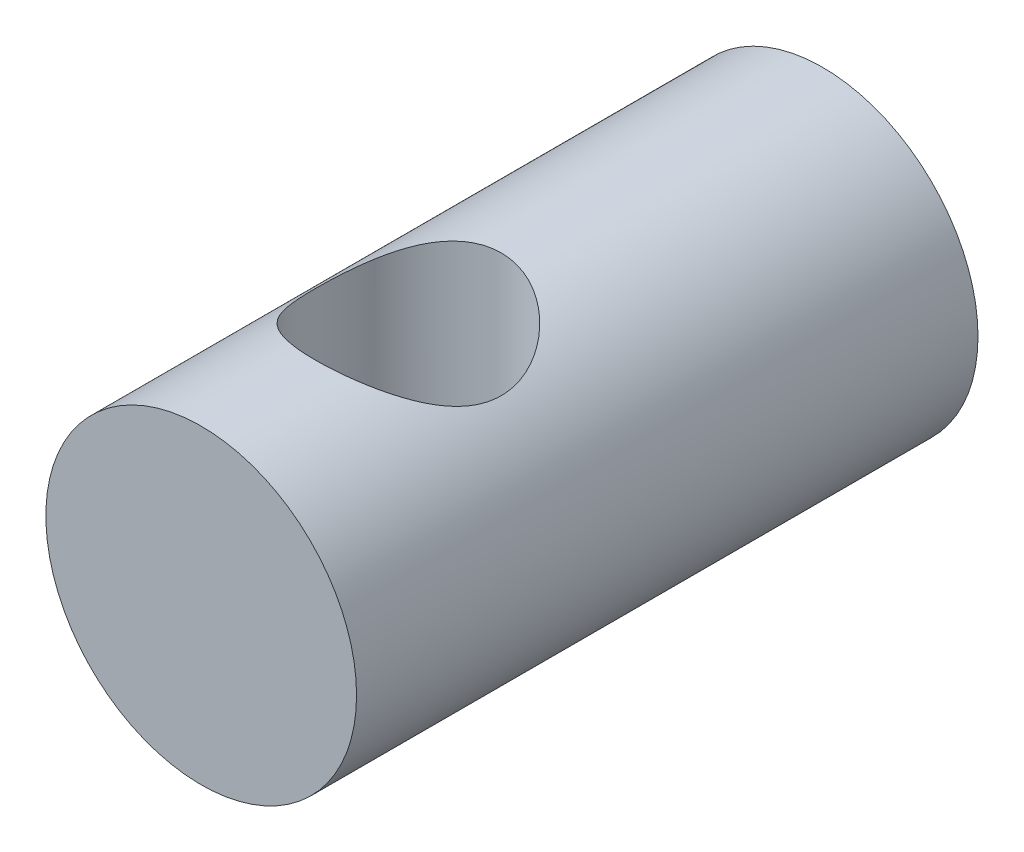
ISO-10303-21;
HEADER;
FILE_DESCRIPTION(('STEP AP214'),'2;1');
FILE_NAME('part.step','',(''),(''),'','','');
FILE_SCHEMA(('AUTOMOTIVE_DESIGN { 1 0 10303 214 1 1 1 1 }'));
ENDSEC;
DATA;
#1=APPLICATION_CONTEXT('core data for automotive mechanical design processes');
#2=APPLICATION_PROTOCOL_DEFINITION('international standard','automotive_design',2000,#1);
#3=PRODUCT_CONTEXT('',#1,'mechanical');
#4=PRODUCT('Part','Part','',(#3));
#5=PRODUCT_RELATED_PRODUCT_CATEGORY('part','',(#4));
#6=PRODUCT_DEFINITION_FORMATION('','',#4);
#7=PRODUCT_DEFINITION_CONTEXT('part definition',#1,'design');
#8=PRODUCT_DEFINITION('design','',#6,#7);
#9=PRODUCT_DEFINITION_SHAPE('','',#8);
#10=(LENGTH_UNIT() NAMED_UNIT(*) SI_UNIT(.MILLI.,.METRE.));
#11=(NAMED_UNIT(*) PLANE_ANGLE_UNIT() SI_UNIT($,.RADIAN.));
#12=(NAMED_UNIT(*) SI_UNIT($,.STERADIAN.) SOLID_ANGLE_UNIT());
#13=UNCERTAINTY_MEASURE_WITH_UNIT(LENGTH_MEASURE(1.E-05),#10,'distance_accuracy_value','');
#14=(GEOMETRIC_REPRESENTATION_CONTEXT(3) GLOBAL_UNCERTAINTY_ASSIGNED_CONTEXT((#13)) GLOBAL_UNIT_ASSIGNED_CONTEXT((#10,
#11,#12)) REPRESENTATION_CONTEXT('',''));
#15=CARTESIAN_POINT('',(0.,0.,0.));
#16=DIRECTION('',(0.,0.,1.));
#17=DIRECTION('',(1.,0.,0.));
#18=AXIS2_PLACEMENT_3D('',#15,#16,#17);
#19=CARTESIAN_POINT('',(0.,0.,12.7));
#20=DIRECTION('',(0.,0.,-1.));
#21=DIRECTION('',(-1.,0.,0.));
#22=AXIS2_PLACEMENT_3D('',#19,#20,#21);
#23=CYLINDRICAL_SURFACE('',#22,3.175);
#24=CARTESIAN_POINT('',(0.,-3.175,10.365316582));
#25=CARTESIAN_POINT('',(0.097172169504171,-3.17499473733448,10.3653107740274));
#26=CARTESIAN_POINT('',(0.194505772171724,-3.1704899351168,10.3578039193283));
#27=CARTESIAN_POINT('',(0.386247876195257,-3.15289724445,10.3281566819524));
#28=CARTESIAN_POINT('',(0.48064841814607,-3.13978783032978,10.3059795985024));
#29=CARTESIAN_POINT('',(0.663338202960632,-3.10631453914764,10.2482349678898));
#30=CARTESIAN_POINT('',(0.75165520508708,-3.08598663827969,10.2127337776368));
#31=CARTESIAN_POINT('',(0.920802871190098,-3.03980996111726,10.1297592927874));
#32=CARTESIAN_POINT('',(1.00163547058606,-3.0139626178641,10.0822891051864));
#33=CARTESIAN_POINT('',(1.16049252060854,-2.95661027604282,9.97270073098784));
#34=CARTESIAN_POINT('',(1.23783381861576,-2.92482426540909,9.90974208688833));
#35=CARTESIAN_POINT('',(1.38152642634457,-2.85976318298787,9.77285265622814));
#36=CARTESIAN_POINT('',(1.44786347487478,-2.82648624881524,9.69890786345869));
#37=CARTESIAN_POINT('',(1.57584554094794,-2.7573969106236,9.53155790583001));
#38=CARTESIAN_POINT('',(1.6359388108928,-2.72176832488568,9.43687972758724));
#39=CARTESIAN_POINT('',(1.73913402629444,-2.65702180796901,9.23667491079906));
#40=CARTESIAN_POINT('',(1.78226344099681,-2.62789338457552,9.131166162321));
#41=CARTESIAN_POINT('',(1.84124574883968,-2.58677571161618,8.93813594880242));
#42=CARTESIAN_POINT('',(1.86116114936056,-2.57235066712384,8.85237681030291));
#43=CARTESIAN_POINT('',(1.88891287200302,-2.55204635151922,8.67797576197779));
#44=CARTESIAN_POINT('',(1.89676405751958,-2.54615656527941,8.58933753703125));
#45=CARTESIAN_POINT('',(1.89993521562899,-2.54379182699535,8.41153783263795));
#46=CARTESIAN_POINT('',(1.89523118653523,-2.54733490764222,8.32237567657212));
#47=CARTESIAN_POINT('',(1.87353957703253,-2.56332717440686,8.1463563269842));
#48=CARTESIAN_POINT('',(1.85654281014564,-2.57578302104399,8.05950090766198));
#49=CARTESIAN_POINT('',(1.81144682058197,-2.60768613385456,7.89131495149002));
#50=CARTESIAN_POINT('',(1.78348568689054,-2.62704618159416,7.80992990634508));
#51=CARTESIAN_POINT('',(1.7174830741452,-2.67066254406486,7.65278942963934));
#52=CARTESIAN_POINT('',(1.67943788818222,-2.69492065854811,7.57703608143616));
#53=CARTESIAN_POINT('',(1.58672414020791,-2.75069759525318,7.41931820479224));
#54=CARTESIAN_POINT('',(1.53031553227878,-2.78274553828709,7.33856308020759));
#55=CARTESIAN_POINT('',(1.40589250511398,-2.84763476747711,7.18683119944632));
#56=CARTESIAN_POINT('',(1.33786706770623,-2.88047678116024,7.11586384322752));
#57=CARTESIAN_POINT('',(1.1810184925224,-2.94857405920886,6.9758353773754));
#58=CARTESIAN_POINT('',(1.0906218793418,-2.98354055000555,6.90837705511171));
#59=CARTESIAN_POINT('',(0.897655771105431,-3.04715194844812,6.78979934297001));
#60=CARTESIAN_POINT('',(0.795092934616743,-3.07580028968896,6.73867107172912));
#61=CARTESIAN_POINT('',(0.587246926940642,-3.12191592586998,6.65790107119861));
#62=CARTESIAN_POINT('',(0.482552010341208,-3.13997863496482,6.62709924982464));
#63=CARTESIAN_POINT('',(0.268218469351468,-3.16548279140979,6.58389176699014));
#64=CARTESIAN_POINT('',(0.158585853436774,-3.17293680604301,6.57146433815708));
#65=CARTESIAN_POINT('',(-0.0464594408306201,-3.17608971445388,6.56619651713815));
#66=CARTESIAN_POINT('',(-0.141797439375055,-3.17323736279414,6.57094225903338));
#67=CARTESIAN_POINT('',(-0.330075000877257,-3.15920579927562,6.59452364476689));
#68=CARTESIAN_POINT('',(-0.423014604928156,-3.14802673018162,6.61335904703255));
#69=CARTESIAN_POINT('',(-0.601841757346878,-3.11872468347478,6.66358778940734));
#70=CARTESIAN_POINT('',(-0.687842979442191,-3.10076906658602,6.69467920637583));
#71=CARTESIAN_POINT('',(-0.853395669196843,-3.05935134067238,6.76819711147863));
#72=CARTESIAN_POINT('',(-0.932945842775101,-3.03588813048196,6.81062586658864));
#73=CARTESIAN_POINT('',(-1.09227149435585,-2.98250562345771,6.91053219907377));
#74=CARTESIAN_POINT('',(-1.17121199585691,-2.9521688658866,6.96911517831521));
#75=CARTESIAN_POINT('',(-1.31874135614903,-2.88928920038512,7.09723008447915));
#76=CARTESIAN_POINT('',(-1.38731797014928,-2.85674374765865,7.1667747674443));
#77=CARTESIAN_POINT('',(-1.52127553416577,-2.78795863350635,7.32530243889645));
#78=CARTESIAN_POINT('',(-1.58510202260847,-2.75178424164386,7.41563574983515));
#79=CARTESIAN_POINT('',(-1.69670447642633,-2.68441351776578,7.60740072133645));
#80=CARTESIAN_POINT('',(-1.74449774143377,-2.65321183947189,7.7088202622717));
#81=CARTESIAN_POINT('',(-1.81359870059369,-2.60630783041182,7.89785071518832));
#82=CARTESIAN_POINT('',(-1.83839773989258,-2.58871328079639,7.98371089566738));
#83=CARTESIAN_POINT('',(-1.87574133757355,-2.56178872180519,8.15926901710409));
#84=CARTESIAN_POINT('',(-1.88830268454364,-2.55244739168528,8.24896152363803));
#85=CARTESIAN_POINT('',(-1.90047164452545,-2.54340279632311,8.43005599464393));
#86=CARTESIAN_POINT('',(-1.90003234357775,-2.54373443676739,8.5214629603417));
#87=CARTESIAN_POINT('',(-1.88611100257841,-2.55407083156873,8.70274107034059));
#88=CARTESIAN_POINT('',(-1.8726217331441,-2.56408094757707,8.79261133526037));
#89=CARTESIAN_POINT('',(-1.83431553008192,-2.59160705495965,8.96420171931602));
#90=CARTESIAN_POINT('',(-1.81004575678639,-2.6087582409512,9.04610659928805));
#91=CARTESIAN_POINT('',(-1.75135686598518,-2.64851399533443,9.20476163253867));
#92=CARTESIAN_POINT('',(-1.7169339342481,-2.67112061258355,9.28150983528362));
#93=CARTESIAN_POINT('',(-1.63283008968824,-2.72347195098669,9.44032370395467));
#94=CARTESIAN_POINT('',(-1.58161638925408,-2.75377977993822,9.52139032781655));
#95=CARTESIAN_POINT('',(-1.46796619901477,-2.81600891017828,9.67458141690084));
#96=CARTESIAN_POINT('',(-1.40552049819928,-2.84793152013772,9.74669846020501));
#97=CARTESIAN_POINT('',(-1.25938084169048,-2.91582938156112,9.89181840377736));
#98=CARTESIAN_POINT('',(-1.1738851968346,-2.95163294738113,9.96310644919709));
#99=CARTESIAN_POINT('',(-0.990349204787433,-3.01817353695183,10.0904152904676));
#100=CARTESIAN_POINT('',(-0.892304594267355,-3.04890883067221,10.1464308773837));
#101=CARTESIAN_POINT('',(-0.689127454968951,-3.10101708385451,10.2392315277227));
#102=CARTESIAN_POINT('',(-0.584333119665005,-3.12266418626807,10.2765873524574));
#103=CARTESIAN_POINT('',(-0.42260364202049,-3.14722498197893,10.3185277566643));
#104=CARTESIAN_POINT('',(-0.367997826631686,-3.15409049809309,10.3301541115143));
#105=CARTESIAN_POINT('',(-0.257714777878128,-3.16500625364528,10.3485723619798));
#106=CARTESIAN_POINT('',(-0.202038485281639,-3.16905885848792,10.3553683196394));
#107=CARTESIAN_POINT('',(-0.12183446499626,-3.17275503945506,10.361560516765));
#108=CARTESIAN_POINT('',(-0.0974978003970843,-3.17359593319021,10.3629680082939));
#109=CARTESIAN_POINT('',(-0.048777482650045,-3.1747190827558,10.3648467845516));
#110=CARTESIAN_POINT('',(-0.0243938280572918,-3.17500132112475,10.3653180400171));
#111=CARTESIAN_POINT('',(0.,-3.175,10.365316582));
#112=B_SPLINE_CURVE_WITH_KNOTS('',3,(#24,#25,#26,#27,#28,#29,#30,#31,#32,#33,#34,#35,#36,#37,
#38,#39,#40,#41,#42,#43,#44,#45,#46,#47,#48,#49,#50,#51,#52,#53,#54,#55,#56,#57,#58,#59,#60,#61,
#62,#63,#64,#65,#66,#67,#68,#69,#70,#71,#72,#73,#74,#75,#76,#77,#78,#79,#80,#81,#82,#83,#84,#85,
#86,#87,#88,#89,#90,#91,#92,#93,#94,#95,#96,#97,#98,#99,#100,#101,#102,#103,#104,#105,#106,#107,
#108,#109,#110,#111),.UNSPECIFIED.,.T.,.F.,(4,2,2,2,2,2,2,2,2,2,2,2,2,2,2,2,2,2,2,2,2,2,2,2,2,2,
2,2,2,2,2,2,2,2,2,2,2,2,2,2,2,2,2,4),(0.,0.291416779287852,0.583565372317157,0.874277903798662,
1.16491504765874,1.47769532259325,1.79087783742579,2.14214785566549,2.49284670402168,
2.75935667027434,3.02553802600597,3.29222860244389,3.55911868544993,3.82275017836242,
4.08647871724115,4.39605203096701,4.70592061211438,5.05838095995927,5.41064928882317,
5.74050489129697,6.06996941369516,6.35503525304086,6.64009620493548,6.91853438364008,
7.19702827961615,7.5044512822629,7.81223470820557,8.15973748058237,8.50686408703163,
8.77899324108165,9.05074853994624,9.32348461042407,9.59637185698692,9.85675961477032,
10.1172453171383,10.4178141100819,10.7186305232669,11.0677182661434,11.4169249228814,
11.7546716756256,11.9231878050201,12.0915620553098,12.1647162172466,12.2378726656745),.UNSPECIFIED.);
#113=CARTESIAN_POINT('',(0.,-3.175,10.365316582));
#114=VERTEX_POINT('',#113);
#115=EDGE_CURVE('E10',#114,#114,#112,.T.);
#116=ORIENTED_EDGE('',*,*,#115,.T.);
#117=EDGE_LOOP('',(#116));
#118=FACE_BOUND('',#117,.T.);
#119=CARTESIAN_POINT('',(0.,3.175,10.365316582));
#120=CARTESIAN_POINT('',(-0.097172169504171,3.17499473733448,10.3653107740274));
#121=CARTESIAN_POINT('',(-0.194505772171724,3.1704899351168,10.3578039193283));
#122=CARTESIAN_POINT('',(-0.386247876195257,3.15289724445,10.3281566819524));
#123=CARTESIAN_POINT('',(-0.48064841814607,3.13978783032978,10.3059795985024));
#124=CARTESIAN_POINT('',(-0.663338202960632,3.10631453914764,10.2482349678898));
#125=CARTESIAN_POINT('',(-0.75165520508708,3.08598663827969,10.2127337776368));
#126=CARTESIAN_POINT('',(-0.920802871190098,3.03980996111726,10.1297592927874));
#127=CARTESIAN_POINT('',(-1.00163547058606,3.0139626178641,10.0822891051864));
#128=CARTESIAN_POINT('',(-1.16049252060854,2.95661027604282,9.97270073098784));
#129=CARTESIAN_POINT('',(-1.23783381861576,2.92482426540909,9.90974208688833));
#130=CARTESIAN_POINT('',(-1.38152642634457,2.85976318298788,9.77285265622814));
#131=CARTESIAN_POINT('',(-1.44786347487478,2.82648624881524,9.69890786345869));
#132=CARTESIAN_POINT('',(-1.57584554094794,2.7573969106236,9.53155790583001));
#133=CARTESIAN_POINT('',(-1.6359388108928,2.72176832488568,9.43687972758724));
#134=CARTESIAN_POINT('',(-1.73913402629444,2.65702180796901,9.23667491079906));
#135=CARTESIAN_POINT('',(-1.78226344099681,2.62789338457552,9.131166162321));
#136=CARTESIAN_POINT('',(-1.84124574883968,2.58677571161618,8.93813594880242));
#137=CARTESIAN_POINT('',(-1.86116114936056,2.57235066712384,8.8523768103029));
#138=CARTESIAN_POINT('',(-1.88891287200302,2.55204635151922,8.67797576197779));
#139=CARTESIAN_POINT('',(-1.89676405751958,2.54615656527941,8.58933753703125));
#140=CARTESIAN_POINT('',(-1.89993521562899,2.54379182699535,8.41153783263795));
#141=CARTESIAN_POINT('',(-1.89523118653523,2.54733490764222,8.32237567657212));
#142=CARTESIAN_POINT('',(-1.87353957703253,2.56332717440686,8.1463563269842));
#143=CARTESIAN_POINT('',(-1.85654281014564,2.57578302104399,8.05950090766198));
#144=CARTESIAN_POINT('',(-1.81144682058197,2.60768613385456,7.89131495149002));
#145=CARTESIAN_POINT('',(-1.78348568689054,2.62704618159416,7.80992990634508));
#146=CARTESIAN_POINT('',(-1.7174830741452,2.67066254406486,7.65278942963934));
#147=CARTESIAN_POINT('',(-1.67943788818222,2.69492065854811,7.57703608143616));
#148=CARTESIAN_POINT('',(-1.58672414020791,2.75069759525318,7.41931820479224));
#149=CARTESIAN_POINT('',(-1.53031553227878,2.78274553828709,7.33856308020759));
#150=CARTESIAN_POINT('',(-1.40589250511398,2.84763476747711,7.18683119944632));
#151=CARTESIAN_POINT('',(-1.33786706770623,2.88047678116024,7.11586384322752));
#152=CARTESIAN_POINT('',(-1.1810184925224,2.94857405920886,6.9758353773754));
#153=CARTESIAN_POINT('',(-1.0906218793418,2.98354055000554,6.90837705511171));
#154=CARTESIAN_POINT('',(-0.897655771105433,3.04715194844812,6.78979934297001));
#155=CARTESIAN_POINT('',(-0.795092934616743,3.07580028968896,6.73867107172912));
#156=CARTESIAN_POINT('',(-0.587246926940642,3.12191592586998,6.65790107119861));
#157=CARTESIAN_POINT('',(-0.482552010341208,3.13997863496482,6.62709924982464));
#158=CARTESIAN_POINT('',(-0.268218469351468,3.16548279140979,6.58389176699014));
#159=CARTESIAN_POINT('',(-0.158585853436774,3.17293680604301,6.57146433815708));
#160=CARTESIAN_POINT('',(0.0464594408306201,3.17608971445388,6.56619651713815));
#161=CARTESIAN_POINT('',(0.141797439375055,3.17323736279414,6.57094225903338));
#162=CARTESIAN_POINT('',(0.330075000877257,3.15920579927562,6.59452364476689));
#163=CARTESIAN_POINT('',(0.423014604928156,3.14802673018162,6.61335904703255));
#164=CARTESIAN_POINT('',(0.601841757346878,3.11872468347478,6.66358778940734));
#165=CARTESIAN_POINT('',(0.687842979442191,3.10076906658602,6.69467920637583));
#166=CARTESIAN_POINT('',(0.853395669196843,3.05935134067238,6.76819711147863));
#167=CARTESIAN_POINT('',(0.932945842775101,3.03588813048196,6.81062586658864));
#168=CARTESIAN_POINT('',(1.09227149435585,2.98250562345771,6.91053219907377));
#169=CARTESIAN_POINT('',(1.17121199585691,2.9521688658866,6.96911517831521));
#170=CARTESIAN_POINT('',(1.31874135614903,2.88928920038512,7.09723008447915));
#171=CARTESIAN_POINT('',(1.38731797014928,2.85674374765865,7.1667747674443));
#172=CARTESIAN_POINT('',(1.52127553416577,2.78795863350635,7.32530243889645));
#173=CARTESIAN_POINT('',(1.58510202260847,2.75178424164386,7.41563574983515));
#174=CARTESIAN_POINT('',(1.69670447642633,2.68441351776578,7.60740072133645));
#175=CARTESIAN_POINT('',(1.74449774143377,2.65321183947189,7.7088202622717));
#176=CARTESIAN_POINT('',(1.81359870059369,2.60630783041182,7.89785071518832));
#177=CARTESIAN_POINT('',(1.83839773989258,2.58871328079639,7.98371089566738));
#178=CARTESIAN_POINT('',(1.87574133757355,2.56178872180519,8.15926901710409));
#179=CARTESIAN_POINT('',(1.88830268454364,2.55244739168528,8.24896152363803));
#180=CARTESIAN_POINT('',(1.90047164452545,2.54340279632311,8.43005599464393));
#181=CARTESIAN_POINT('',(1.90003234357775,2.54373443676739,8.5214629603417));
#182=CARTESIAN_POINT('',(1.88611100257841,2.55407083156873,8.70274107034059));
#183=CARTESIAN_POINT('',(1.8726217331441,2.56408094757707,8.79261133526037));
#184=CARTESIAN_POINT('',(1.83431553008192,2.59160705495965,8.96420171931602));
#185=CARTESIAN_POINT('',(1.81004575678639,2.6087582409512,9.04610659928805));
#186=CARTESIAN_POINT('',(1.75135686598518,2.64851399533443,9.20476163253867));
#187=CARTESIAN_POINT('',(1.7169339342481,2.67112061258355,9.28150983528362));
#188=CARTESIAN_POINT('',(1.63283008968824,2.72347195098669,9.44032370395467));
#189=CARTESIAN_POINT('',(1.58161638925408,2.75377977993822,9.52139032781655));
#190=CARTESIAN_POINT('',(1.46796619901477,2.81600891017828,9.67458141690084));
#191=CARTESIAN_POINT('',(1.40552049819928,2.84793152013772,9.74669846020501));
#192=CARTESIAN_POINT('',(1.25938084169048,2.91582938156112,9.89181840377736));
#193=CARTESIAN_POINT('',(1.1738851968346,2.95163294738113,9.96310644919709));
#194=CARTESIAN_POINT('',(0.990349204787433,3.01817353695183,10.0904152904676));
#195=CARTESIAN_POINT('',(0.892304594267355,3.04890883067221,10.1464308773837));
#196=CARTESIAN_POINT('',(0.689127454968951,3.10101708385451,10.2392315277227));
#197=CARTESIAN_POINT('',(0.584333119665004,3.12266418626807,10.2765873524574));
#198=CARTESIAN_POINT('',(0.422603642020491,3.14722498197893,10.3185277566643));
#199=CARTESIAN_POINT('',(0.367997826631687,3.15409049809309,10.3301541115143));
#200=CARTESIAN_POINT('',(0.257714777878129,3.16500625364528,10.3485723619798));
#201=CARTESIAN_POINT('',(0.202038485281639,3.16905885848792,10.3553683196394));
#202=CARTESIAN_POINT('',(0.12183446499626,3.17275503945506,10.361560516765));
#203=CARTESIAN_POINT('',(0.0974978003970843,3.17359593319021,10.3629680082939));
#204=CARTESIAN_POINT('',(0.0487774826500449,3.1747190827558,10.3648467845516));
#205=CARTESIAN_POINT('',(0.0243938280572918,3.17500132112475,10.3653180400171));
#206=CARTESIAN_POINT('',(0.,3.175,10.365316582));
#207=B_SPLINE_CURVE_WITH_KNOTS('',3,(#119,#120,#121,#122,#123,#124,#125,#126,#127,#128,#129,
#130,#131,#132,#133,#134,#135,#136,#137,#138,#139,#140,#141,#142,#143,#144,#145,#146,#147,#148,
#149,#150,#151,#152,#153,#154,#155,#156,#157,#158,#159,#160,#161,#162,#163,#164,#165,#166,#167,
#168,#169,#170,#171,#172,#173,#174,#175,#176,#177,#178,#179,#180,#181,#182,#183,#184,#185,#186,
#187,#188,#189,#190,#191,#192,#193,#194,#195,#196,#197,#198,#199,#200,#201,#202,#203,#204,#205,
#206),.UNSPECIFIED.,.T.,.F.,(4,2,2,2,2,2,2,2,2,2,2,2,2,2,2,2,2,2,2,2,2,2,2,2,2,2,2,2,2,2,2,2,2,
2,2,2,2,2,2,2,2,2,2,4),(0.,0.291416779287852,0.583565372317157,0.874277903798662,
1.16491504765874,1.47769532259325,1.79087783742579,2.14214785566549,2.49284670402168,
2.75935667027435,3.02553802600597,3.2922286024439,3.55911868544993,3.82275017836242,
4.08647871724115,4.39605203096701,4.70592061211438,5.05838095995927,5.41064928882317,
5.74050489129697,6.06996941369516,6.35503525304086,6.64009620493548,6.91853438364008,
7.19702827961615,7.5044512822629,7.81223470820557,8.15973748058237,8.50686408703163,
8.77899324108165,9.05074853994624,9.32348461042407,9.59637185698692,9.85675961477032,
10.1172453171383,10.4178141100819,10.7186305232669,11.0677182661434,11.4169249228814,
11.7546716756256,11.9231878050201,12.0915620553098,12.1647162172466,12.2378726656745),.UNSPECIFIED.);
#208=CARTESIAN_POINT('',(0.,3.175,10.365316582));
#209=VERTEX_POINT('',#208);
#210=EDGE_CURVE('E46',#209,#209,#207,.T.);
#211=ORIENTED_EDGE('',*,*,#210,.T.);
#212=EDGE_LOOP('',(#211));
#213=FACE_BOUND('',#212,.T.);
#214=CARTESIAN_POINT('',(0.,0.,12.7));
#215=DIRECTION('',(0.,0.,1.));
#216=DIRECTION('',(1.,0.,0.));
#217=AXIS2_PLACEMENT_3D('',#214,#215,#216);
#218=CIRCLE('',#217,3.175);
#219=CARTESIAN_POINT('',(3.175,0.,12.7));
#220=VERTEX_POINT('',#219);
#221=EDGE_CURVE('E50',#220,#220,#218,.T.);
#222=ORIENTED_EDGE('',*,*,#221,.F.);
#223=EDGE_LOOP('',(#222));
#224=FACE_BOUND('',#223,.T.);
#225=CARTESIAN_POINT('',(0.,0.,0.));
#226=DIRECTION('',(0.,0.,1.));
#227=DIRECTION('',(1.,0.,0.));
#228=AXIS2_PLACEMENT_3D('',#225,#226,#227);
#229=CIRCLE('',#228,3.175);
#230=CARTESIAN_POINT('',(3.175,0.,0.));
#231=VERTEX_POINT('',#230);
#232=EDGE_CURVE('E54',#231,#231,#229,.T.);
#233=ORIENTED_EDGE('',*,*,#232,.T.);
#234=EDGE_LOOP('',(#233));
#235=FACE_BOUND('',#234,.T.);
#236=ADVANCED_FACE('F35',(#118,#213,#224,#235),#23,.T.);
#237=CARTESIAN_POINT('',(0.,0.,12.7));
#238=DIRECTION('',(0.,0.,1.));
#239=DIRECTION('',(1.,0.,0.));
#240=AXIS2_PLACEMENT_3D('',#237,#238,#239);
#241=PLANE('',#240);
#242=ORIENTED_EDGE('',*,*,#221,.T.);
#243=EDGE_LOOP('',(#242));
#244=FACE_BOUND('',#243,.T.);
#245=ADVANCED_FACE('F66',(#244),#241,.T.);
#246=CARTESIAN_POINT('',(0.,0.,0.));
#247=DIRECTION('',(0.,0.,1.));
#248=DIRECTION('',(1.,0.,0.));
#249=AXIS2_PLACEMENT_3D('',#246,#247,#248);
#250=PLANE('',#249);
#251=ORIENTED_EDGE('',*,*,#232,.F.);
#252=EDGE_LOOP('',(#251));
#253=FACE_BOUND('',#252,.T.);
#254=ADVANCED_FACE('F64',(#253),#250,.F.);
#255=CARTESIAN_POINT('',(0.,3.175,8.466666582));
#256=DIRECTION('',(0.,1.,0.));
#257=DIRECTION('',(0.,0.,1.));
#258=AXIS2_PLACEMENT_3D('',#255,#256,#257);
#259=CYLINDRICAL_SURFACE('',#258,1.89864999999999);
#260=ORIENTED_EDGE('',*,*,#210,.F.);
#261=EDGE_LOOP('',(#260));
#262=FACE_BOUND('',#261,.T.);
#263=ORIENTED_EDGE('',*,*,#115,.F.);
#264=EDGE_LOOP('',(#263));
#265=FACE_BOUND('',#264,.T.);
#266=ADVANCED_FACE('F60',(#262,#265),#259,.F.);
#267=CLOSED_SHELL('',(#236,#245,#254,#266));
#268=MANIFOLD_SOLID_BREP('B2',#267);
#269=ADVANCED_BREP_SHAPE_REPRESENTATION('',(#18,#268),#14);
#270=SHAPE_DEFINITION_REPRESENTATION(#9,#269);
ENDSEC;
END-ISO-10303-21;
